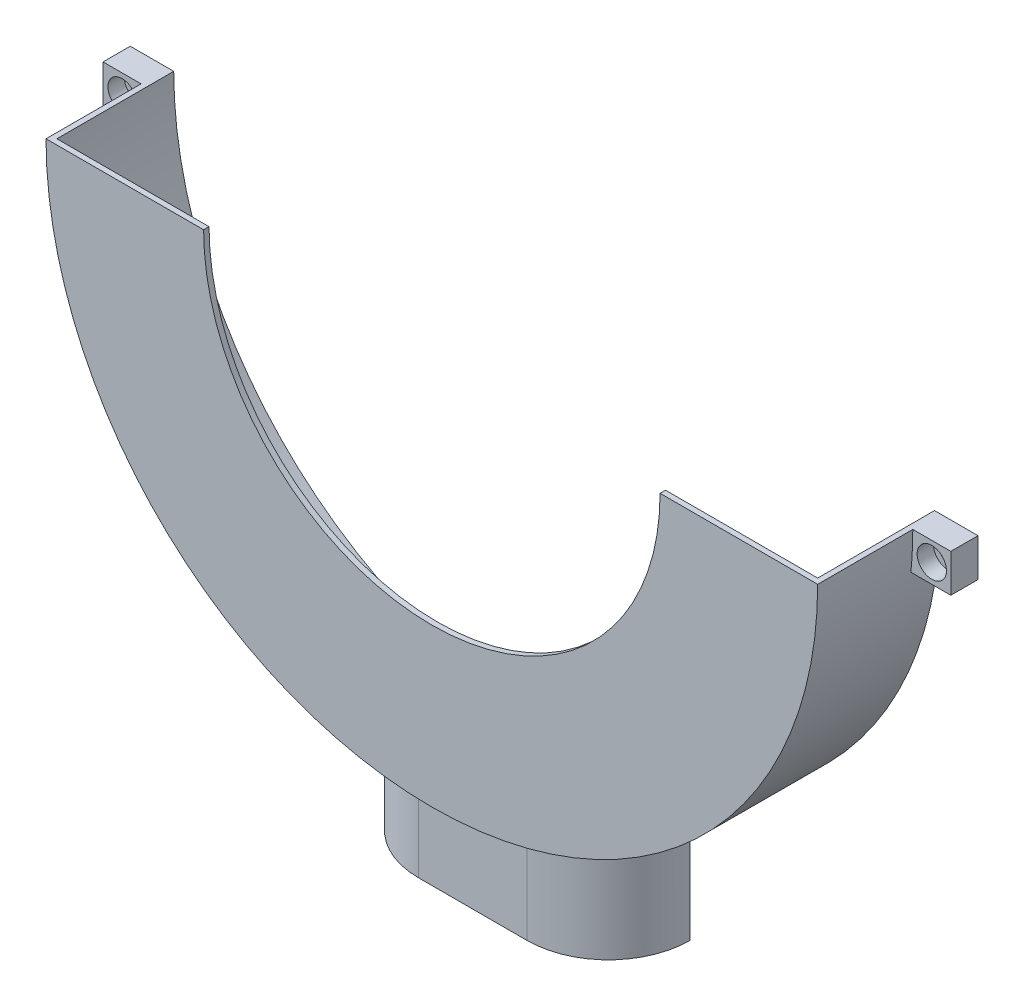
ISO-10303-21;
HEADER;
FILE_DESCRIPTION(('STEP AP214'),'2;1');
FILE_NAME('part.step','',(''),(''),'','','');
FILE_SCHEMA(('AUTOMOTIVE_DESIGN { 1 0 10303 214 1 1 1 1 }'));
ENDSEC;
DATA;
#1=APPLICATION_CONTEXT('core data for automotive mechanical design processes');
#2=APPLICATION_PROTOCOL_DEFINITION('international standard','automotive_design',2000,#1);
#3=PRODUCT_CONTEXT('',#1,'mechanical');
#4=PRODUCT('Part','Part','',(#3));
#5=PRODUCT_RELATED_PRODUCT_CATEGORY('part','',(#4));
#6=PRODUCT_DEFINITION_FORMATION('','',#4);
#7=PRODUCT_DEFINITION_CONTEXT('part definition',#1,'design');
#8=PRODUCT_DEFINITION('design','',#6,#7);
#9=PRODUCT_DEFINITION_SHAPE('','',#8);
#10=(LENGTH_UNIT() NAMED_UNIT(*) SI_UNIT(.MILLI.,.METRE.));
#11=(NAMED_UNIT(*) PLANE_ANGLE_UNIT() SI_UNIT($,.RADIAN.));
#12=(NAMED_UNIT(*) SI_UNIT($,.STERADIAN.) SOLID_ANGLE_UNIT());
#13=UNCERTAINTY_MEASURE_WITH_UNIT(LENGTH_MEASURE(1.E-05),#10,'distance_accuracy_value','');
#14=(GEOMETRIC_REPRESENTATION_CONTEXT(3) GLOBAL_UNCERTAINTY_ASSIGNED_CONTEXT((#13)) GLOBAL_UNIT_ASSIGNED_CONTEXT((#10,
#11,#12)) REPRESENTATION_CONTEXT('',''));
#15=CARTESIAN_POINT('',(0.,0.,0.));
#16=DIRECTION('',(0.,0.,1.));
#17=DIRECTION('',(1.,0.,0.));
#18=AXIS2_PLACEMENT_3D('',#15,#16,#17);
#19=CARTESIAN_POINT('',(0.,0.,0.));
#20=DIRECTION('',(0.,0.,1.));
#21=DIRECTION('',(1.,0.,0.));
#22=AXIS2_PLACEMENT_3D('',#19,#20,#21);
#23=PLANE('',#22);
#24=CARTESIAN_POINT('',(74.5,-3.49999999999999,0.));
#25=DIRECTION('',(0.,0.,-1.));
#26=DIRECTION('',(-1.,0.,0.));
#27=AXIS2_PLACEMENT_3D('',#24,#25,#26);
#28=CIRCLE('',#27,1.60000000000001);
#29=CARTESIAN_POINT('',(72.9,-3.49999999999999,0.));
#30=VERTEX_POINT('',#29);
#31=EDGE_CURVE('E338',#30,#30,#28,.T.);
#32=ORIENTED_EDGE('',*,*,#31,.F.);
#33=EDGE_LOOP('',(#32));
#34=FACE_BOUND('',#33,.T.);
#35=CARTESIAN_POINT('',(-74.5,-3.50000000000002,0.));
#36=DIRECTION('',(0.,0.,1.));
#37=DIRECTION('',(1.,0.,0.));
#38=AXIS2_PLACEMENT_3D('',#35,#36,#37);
#39=CIRCLE('',#38,1.60000000000001);
#40=CARTESIAN_POINT('',(-72.9,-3.50000000000002,0.));
#41=VERTEX_POINT('',#40);
#42=EDGE_CURVE('E356',#41,#41,#39,.T.);
#43=ORIENTED_EDGE('',*,*,#42,.T.);
#44=EDGE_LOOP('',(#43));
#45=FACE_BOUND('',#44,.T.);
#46=DIRECTION('',(0.,-1.,0.));
#47=VECTOR('',#46,1.);
#48=CARTESIAN_POINT('',(21.6189500386222,-71.,0.));
#49=LINE('',#48,#47);
#50=CARTESIAN_POINT('',(21.6189500386222,-71.,0.));
#51=VERTEX_POINT('',#50);
#52=CARTESIAN_POINT('',(21.6189500386222,-91.,0.));
#53=VERTEX_POINT('',#52);
#54=EDGE_CURVE('E304',#51,#53,#49,.T.);
#55=ORIENTED_EDGE('',*,*,#54,.F.);
#56=DIRECTION('',(1.,0.,0.));
#57=VECTOR('',#56,1.);
#58=CARTESIAN_POINT('',(0.,-71.,0.));
#59=LINE('',#58,#57);
#60=CARTESIAN_POINT('',(-21.6189500386223,-71.,0.));
#61=VERTEX_POINT('',#60);
#62=EDGE_CURVE('E270',#61,#51,#59,.T.);
#63=ORIENTED_EDGE('',*,*,#62,.F.);
#64=DIRECTION('',(0.,-1.,0.));
#65=VECTOR('',#64,1.);
#66=CARTESIAN_POINT('',(-21.6189500386223,-71.,0.));
#67=LINE('',#66,#65);
#68=CARTESIAN_POINT('',(-21.6189500386223,-91.,0.));
#69=VERTEX_POINT('',#68);
#70=EDGE_CURVE('E307',#61,#69,#67,.T.);
#71=ORIENTED_EDGE('',*,*,#70,.T.);
#72=DIRECTION('',(-1.,0.,0.));
#73=VECTOR('',#72,1.);
#74=CARTESIAN_POINT('',(0.,-91.,0.));
#75=LINE('',#74,#73);
#76=CARTESIAN_POINT('',(-25.,-91.,0.));
#77=VERTEX_POINT('',#76);
#78=EDGE_CURVE('E390',#69,#77,#75,.T.);
#79=ORIENTED_EDGE('',*,*,#78,.T.);
#80=DIRECTION('',(0.,1.,0.));
#81=VECTOR('',#80,1.);
#82=CARTESIAN_POINT('',(-25.,0.,0.));
#83=LINE('',#82,#81);
#84=CARTESIAN_POINT('',(-25.,-66.4529909033446,0.));
#85=VERTEX_POINT('',#84);
#86=EDGE_CURVE('E384',#77,#85,#83,.T.);
#87=ORIENTED_EDGE('',*,*,#86,.T.);
#88=CARTESIAN_POINT('',(0.,0.,0.));
#89=DIRECTION('',(0.,0.,1.));
#90=DIRECTION('',(1.,0.,0.));
#91=AXIS2_PLACEMENT_3D('',#88,#89,#90);
#92=CIRCLE('',#91,71.);
#93=CARTESIAN_POINT('',(-70.6540869306228,-7.00000000000003,0.));
#94=VERTEX_POINT('',#93);
#95=EDGE_CURVE('E430',#94,#85,#92,.T.);
#96=ORIENTED_EDGE('',*,*,#95,.F.);
#97=DIRECTION('',(1.,0.,0.));
#98=VECTOR('',#97,1.);
#99=CARTESIAN_POINT('',(-73.,-7.00000000000003,0.));
#100=LINE('',#99,#98);
#101=CARTESIAN_POINT('',(-78.,-7.00000000000003,0.));
#102=VERTEX_POINT('',#101);
#103=EDGE_CURVE('E365',#102,#94,#100,.T.);
#104=ORIENTED_EDGE('',*,*,#103,.F.);
#105=DIRECTION('',(0.,-1.,0.));
#106=VECTOR('',#105,1.);
#107=CARTESIAN_POINT('',(-78.,0.,0.));
#108=LINE('',#107,#106);
#109=CARTESIAN_POINT('',(-78.,0.,0.));
#110=VERTEX_POINT('',#109);
#111=EDGE_CURVE('E359',#110,#102,#108,.T.);
#112=ORIENTED_EDGE('',*,*,#111,.F.);
#113=DIRECTION('',(1.,0.,0.));
#114=VECTOR('',#113,1.);
#115=CARTESIAN_POINT('',(0.,0.,0.));
#116=LINE('',#115,#114);
#117=CARTESIAN_POINT('',(-70.,0.,0.));
#118=VERTEX_POINT('',#117);
#119=EDGE_CURVE('E426',#110,#118,#116,.T.);
#120=ORIENTED_EDGE('',*,*,#119,.T.);
#121=CARTESIAN_POINT('',(0.,0.,0.));
#122=DIRECTION('',(0.,0.,1.));
#123=DIRECTION('',(1.,0.,0.));
#124=AXIS2_PLACEMENT_3D('',#121,#122,#123);
#125=CIRCLE('',#124,70.);
#126=CARTESIAN_POINT('',(70.,0.,0.));
#127=VERTEX_POINT('',#126);
#128=EDGE_CURVE('E419',#118,#127,#125,.T.);
#129=ORIENTED_EDGE('',*,*,#128,.T.);
#130=CARTESIAN_POINT('',(78.,0.,0.));
#131=VERTEX_POINT('',#130);
#132=EDGE_CURVE('E424',#127,#131,#116,.T.);
#133=ORIENTED_EDGE('',*,*,#132,.T.);
#134=DIRECTION('',(0.,-1.,0.));
#135=VECTOR('',#134,1.);
#136=CARTESIAN_POINT('',(78.,0.,0.));
#137=LINE('',#136,#135);
#138=CARTESIAN_POINT('',(78.,-7.,0.));
#139=VERTEX_POINT('',#138);
#140=EDGE_CURVE('E331',#131,#139,#137,.T.);
#141=ORIENTED_EDGE('',*,*,#140,.T.);
#142=DIRECTION('',(-1.,0.,0.));
#143=VECTOR('',#142,1.);
#144=CARTESIAN_POINT('',(0.,-7.,0.));
#145=LINE('',#144,#143);
#146=CARTESIAN_POINT('',(70.6540869306228,-7.,0.));
#147=VERTEX_POINT('',#146);
#148=EDGE_CURVE('E341',#139,#147,#145,.T.);
#149=ORIENTED_EDGE('',*,*,#148,.T.);
#150=CARTESIAN_POINT('',(25.,-66.4529909033446,0.));
#151=VERTEX_POINT('',#150);
#152=EDGE_CURVE('E429',#151,#147,#92,.T.);
#153=ORIENTED_EDGE('',*,*,#152,.F.);
#154=DIRECTION('',(0.,1.,0.));
#155=VECTOR('',#154,1.);
#156=CARTESIAN_POINT('',(25.,0.,0.));
#157=LINE('',#156,#155);
#158=CARTESIAN_POINT('',(25.,-91.,0.));
#159=VERTEX_POINT('',#158);
#160=EDGE_CURVE('E387',#159,#151,#157,.T.);
#161=ORIENTED_EDGE('',*,*,#160,.F.);
#162=EDGE_CURVE('E391',#159,#53,#75,.T.);
#163=ORIENTED_EDGE('',*,*,#162,.T.);
#164=EDGE_LOOP('',(#55,#63,#71,#79,#87,#96,#104,#112,#120,#129,#133,#141,#149,#153,#161,#163));
#165=FACE_BOUND('',#164,.T.);
#166=ADVANCED_FACE('F107',(#34,#45,#165),#23,.F.);
#167=CARTESIAN_POINT('',(0.,-91.,15.));
#168=DIRECTION('',(0.,-1.,0.));
#169=DIRECTION('',(0.,0.,-1.));
#170=AXIS2_PLACEMENT_3D('',#167,#168,#169);
#171=PLANE('',#170);
#172=CARTESIAN_POINT('',(10.,-91.,0.));
#173=DIRECTION('',(0.,-1.,0.));
#174=DIRECTION('',(0.,0.,-1.));
#175=AXIS2_PLACEMENT_3D('',#172,#173,#174);
#176=CIRCLE('',#175,12.);
#177=CARTESIAN_POINT('',(21.6189500386222,-91.,3.));
#178=VERTEX_POINT('',#177);
#179=CARTESIAN_POINT('',(10.,-91.,12.));
#180=VERTEX_POINT('',#179);
#181=EDGE_CURVE('E295',#178,#180,#176,.T.);
#182=ORIENTED_EDGE('',*,*,#181,.F.);
#183=DIRECTION('',(0.,0.,-1.));
#184=VECTOR('',#183,1.);
#185=CARTESIAN_POINT('',(21.6189500386222,-91.,0.));
#186=LINE('',#185,#184);
#187=EDGE_CURVE('E128',#178,#53,#186,.T.);
#188=ORIENTED_EDGE('',*,*,#187,.T.);
#189=ORIENTED_EDGE('',*,*,#162,.F.);
#190=CARTESIAN_POINT('',(10.,-91.,0.));
#191=DIRECTION('',(0.,-1.,0.));
#192=DIRECTION('',(0.,0.,-1.));
#193=AXIS2_PLACEMENT_3D('',#190,#191,#192);
#194=CIRCLE('',#193,15.);
#195=CARTESIAN_POINT('',(10.,-91.,15.));
#196=VERTEX_POINT('',#195);
#197=EDGE_CURVE('E450',#159,#196,#194,.T.);
#198=ORIENTED_EDGE('',*,*,#197,.T.);
#199=DIRECTION('',(-1.,0.,0.));
#200=VECTOR('',#199,1.);
#201=CARTESIAN_POINT('',(0.,-91.,15.));
#202=LINE('',#201,#200);
#203=CARTESIAN_POINT('',(-10.,-91.,15.));
#204=VERTEX_POINT('',#203);
#205=EDGE_CURVE('E381',#196,#204,#202,.T.);
#206=ORIENTED_EDGE('',*,*,#205,.T.);
#207=CARTESIAN_POINT('',(-10.,-91.,0.));
#208=DIRECTION('',(0.,-1.,0.));
#209=DIRECTION('',(0.,0.,-1.));
#210=AXIS2_PLACEMENT_3D('',#207,#208,#209);
#211=CIRCLE('',#210,15.);
#212=EDGE_CURVE('E452',#204,#77,#211,.T.);
#213=ORIENTED_EDGE('',*,*,#212,.T.);
#214=ORIENTED_EDGE('',*,*,#78,.F.);
#215=DIRECTION('',(0.,0.,-1.));
#216=VECTOR('',#215,1.);
#217=CARTESIAN_POINT('',(-21.6189500386223,-91.,0.));
#218=LINE('',#217,#216);
#219=CARTESIAN_POINT('',(-21.6189500386223,-91.,3.));
#220=VERTEX_POINT('',#219);
#221=EDGE_CURVE('E280',#220,#69,#218,.T.);
#222=ORIENTED_EDGE('',*,*,#221,.F.);
#223=CARTESIAN_POINT('',(-10.,-91.,0.));
#224=DIRECTION('',(0.,-1.,0.));
#225=DIRECTION('',(0.,0.,-1.));
#226=AXIS2_PLACEMENT_3D('',#223,#224,#225);
#227=CIRCLE('',#226,12.);
#228=CARTESIAN_POINT('',(-10.,-91.,12.));
#229=VERTEX_POINT('',#228);
#230=EDGE_CURVE('E300',#229,#220,#227,.T.);
#231=ORIENTED_EDGE('',*,*,#230,.F.);
#232=DIRECTION('',(-1.,0.,0.));
#233=VECTOR('',#232,1.);
#234=CARTESIAN_POINT('',(0.,-91.,12.));
#235=LINE('',#234,#233);
#236=EDGE_CURVE('E297',#180,#229,#235,.T.);
#237=ORIENTED_EDGE('',*,*,#236,.F.);
#238=EDGE_LOOP('',(#182,#188,#189,#198,#206,#213,#214,#222,#231,#237));
#239=FACE_BOUND('',#238,.T.);
#240=ADVANCED_FACE('F480',(#239),#171,.T.);
#241=CARTESIAN_POINT('',(74.5,-3.49999999999999,5.));
#242=DIRECTION('',(0.,0.,-1.));
#243=DIRECTION('',(-1.,0.,0.));
#244=AXIS2_PLACEMENT_3D('',#241,#242,#243);
#245=CYLINDRICAL_SURFACE('',#244,1.60000000000001);
#246=ORIENTED_EDGE('',*,*,#31,.T.);
#247=EDGE_LOOP('',(#246));
#248=FACE_BOUND('',#247,.T.);
#249=CARTESIAN_POINT('',(74.5,-3.49999999999999,2.));
#250=DIRECTION('',(0.,0.,1.));
#251=DIRECTION('',(1.,0.,0.));
#252=AXIS2_PLACEMENT_3D('',#249,#250,#251);
#253=CIRCLE('',#252,1.60000000000001);
#254=CARTESIAN_POINT('',(76.1,-3.49999999999999,2.));
#255=VERTEX_POINT('',#254);
#256=EDGE_CURVE('E360',#255,#255,#253,.F.);
#257=ORIENTED_EDGE('',*,*,#256,.F.);
#258=EDGE_LOOP('',(#257));
#259=FACE_BOUND('',#258,.T.);
#260=ADVANCED_FACE('F486',(#248,#259),#245,.F.);
#261=CARTESIAN_POINT('',(-74.5,-3.50000000000002,5.));
#262=DIRECTION('',(0.,0.,-1.));
#263=DIRECTION('',(-1.,0.,0.));
#264=AXIS2_PLACEMENT_3D('',#261,#262,#263);
#265=CYLINDRICAL_SURFACE('',#264,1.60000000000001);
#266=ORIENTED_EDGE('',*,*,#42,.F.);
#267=EDGE_LOOP('',(#266));
#268=FACE_BOUND('',#267,.T.);
#269=CARTESIAN_POINT('',(-74.5,-3.50000000000002,2.));
#270=DIRECTION('',(0.,0.,1.));
#271=DIRECTION('',(1.,0.,0.));
#272=AXIS2_PLACEMENT_3D('',#269,#270,#271);
#273=CIRCLE('',#272,1.60000000000001);
#274=CARTESIAN_POINT('',(-72.9,-3.50000000000002,2.));
#275=VERTEX_POINT('',#274);
#276=EDGE_CURVE('E318',#275,#275,#273,.T.);
#277=ORIENTED_EDGE('',*,*,#276,.T.);
#278=EDGE_LOOP('',(#277));
#279=FACE_BOUND('',#278,.T.);
#280=ADVANCED_FACE('F477',(#268,#279),#265,.F.);
#281=CARTESIAN_POINT('',(0.,0.,21.5));
#282=DIRECTION('',(0.,0.,-1.));
#283=DIRECTION('',(-1.,0.,0.));
#284=AXIS2_PLACEMENT_3D('',#281,#282,#283);
#285=CYLINDRICAL_SURFACE('',#284,71.);
#286=ORIENTED_EDGE('',*,*,#95,.T.);
#287=CARTESIAN_POINT('',(-25.,-66.4529909033446,0.));
#288=CARTESIAN_POINT('',(-25.0000005903524,-66.4529892917345,0.202890123291094));
#289=CARTESIAN_POINT('',(-24.9958827959298,-66.4545399945073,0.405754132783713));
#290=CARTESIAN_POINT('',(-24.9794283711578,-66.4607272766142,0.811094434555971));
#291=CARTESIAN_POINT('',(-24.9670920257694,-66.4653637489557,1.01357074003433));
#292=CARTESIAN_POINT('',(-24.917797028508,-66.4838680768963,1.61974669485583));
#293=CARTESIAN_POINT('',(-24.8685523791685,-66.5023308782734,2.02238403361912));
#294=CARTESIAN_POINT('',(-24.737993198442,-66.5510066828299,2.82038996686675));
#295=CARTESIAN_POINT('',(-24.6567755820139,-66.5811841731827,3.21577678312238));
#296=CARTESIAN_POINT('',(-24.4630499639891,-66.6526056042619,3.99780486330627));
#297=CARTESIAN_POINT('',(-24.3505410103259,-66.6938498817037,4.38444586074817));
#298=CARTESIAN_POINT('',(-24.0953419993637,-66.7864723363784,5.14612284370514));
#299=CARTESIAN_POINT('',(-23.9526689943176,-66.8378447868793,5.52116524936546));
#300=CARTESIAN_POINT('',(-23.638324992462,-66.9496631926846,6.25750406523527));
#301=CARTESIAN_POINT('',(-23.4666523229956,-67.0101096713426,6.61879968107707));
#302=CARTESIAN_POINT('',(-23.0956020324913,-67.1388987831489,7.325612948941));
#303=CARTESIAN_POINT('',(-22.8962112994059,-67.2072451507505,7.67112303022247));
#304=CARTESIAN_POINT('',(-22.4712659315399,-67.3505194327208,8.34421645846842));
#305=CARTESIAN_POINT('',(-22.2457107012023,-67.4254474968928,8.67179939712486));
#306=CARTESIAN_POINT('',(-21.7615525631412,-67.5832961350776,9.31851766812734));
#307=CARTESIAN_POINT('',(-21.5020617801036,-67.6664058484265,9.63694224659087));
#308=CARTESIAN_POINT('',(-20.9583899157298,-67.8367677003514,10.2509462698629));
#309=CARTESIAN_POINT('',(-20.6742009101862,-67.9240211643104,10.5465183247368));
#310=CARTESIAN_POINT('',(-20.0829901748955,-68.1011653816012,11.1130988985723));
#311=CARTESIAN_POINT('',(-19.7759650826353,-68.1910565221346,11.3841037870398));
#312=CARTESIAN_POINT('',(-19.1410012430146,-68.3720048524889,11.8999762900218));
#313=CARTESIAN_POINT('',(-18.8130617028942,-68.4630620864058,12.1448429128263));
#314=CARTESIAN_POINT('',(-18.1218416025611,-68.6493487369842,12.6182231879232));
#315=CARTESIAN_POINT('',(-17.7576183066252,-68.744566193301,12.845366685592));
#316=CARTESIAN_POINT('',(-17.0108165521357,-68.9331587207391,13.2677206815555));
#317=CARTESIAN_POINT('',(-16.6282441960605,-69.0265343900152,13.4629417025938));
#318=CARTESIAN_POINT('',(-15.8472721857437,-69.2100050478546,13.8200473386814));
#319=CARTESIAN_POINT('',(-15.4488785608921,-69.3001012615813,13.9819445105397));
#320=CARTESIAN_POINT('',(-14.6388107248533,-69.4757285989762,14.2711708026575));
#321=CARTESIAN_POINT('',(-14.2271392023012,-69.5612606376462,14.3985068726197));
#322=CARTESIAN_POINT('',(-13.5009067949091,-69.7052730446685,14.5892427530184));
#323=CARTESIAN_POINT('',(-13.1886811773013,-69.7650412692188,14.660662313501));
#324=CARTESIAN_POINT('',(-12.559703961304,-69.881013679575,14.7834554064761));
#325=CARTESIAN_POINT('',(-12.242953253642,-69.9372185552684,14.8348328292425));
#326=CARTESIAN_POINT('',(-11.6062572804768,-70.045691676637,14.9172020304908));
#327=CARTESIAN_POINT('',(-11.2863131375469,-70.0979612540486,14.9482007330017));
#328=CARTESIAN_POINT('',(-10.6443571537927,-70.1983170317084,14.9896100135823));
#329=CARTESIAN_POINT('',(-10.3223447877684,-70.2464021202939,15.0000151365729));
#330=CARTESIAN_POINT('',(-10.,-70.2922470831599,15.));
#331=B_SPLINE_CURVE_WITH_KNOTS('',3,(#287,#288,#289,#290,#291,#292,#293,#294,#295,#296,#297,
#298,#299,#300,#301,#302,#303,#304,#305,#306,#307,#308,#309,#310,#311,#312,#313,#314,#315,#316,
#317,#318,#319,#320,#321,#322,#323,#324,#325,#326,#327,#328,#329,#330),.UNSPECIFIED.,.F.,.F.,(4,
2,2,2,2,2,2,2,2,2,2,2,2,2,2,2,2,2,2,2,2,4),(0.,0.608570725485435,1.21712035115968,
2.43364958759041,3.6465193843696,4.85942608782073,6.07164893913068,7.28394173351149,
8.4968099677002,9.70970581465124,10.9655839571441,12.2218665352263,13.4783344629911,
14.7348500453823,16.052339464034,17.3693937136526,18.6859507698999,20.0022428904329,
20.9790765747016,21.9557205564564,22.9320325344798,23.9086030953595),.UNSPECIFIED.);
#332=CARTESIAN_POINT('',(-10.,-70.2922470831599,15.));
#333=VERTEX_POINT('',#332);
#334=EDGE_CURVE('E121',#85,#333,#331,.T.);
#335=ORIENTED_EDGE('',*,*,#334,.T.);
#336=CARTESIAN_POINT('',(0.,0.,15.));
#337=DIRECTION('',(0.,0.,-1.));
#338=DIRECTION('',(-1.,0.,0.));
#339=AXIS2_PLACEMENT_3D('',#336,#337,#338);
#340=CIRCLE('',#339,71.);
#341=CARTESIAN_POINT('',(10.,-70.2922470831599,15.));
#342=VERTEX_POINT('',#341);
#343=EDGE_CURVE('E383',#342,#333,#340,.T.);
#344=ORIENTED_EDGE('',*,*,#343,.F.);
#345=CARTESIAN_POINT('',(10.,-70.2922470831599,15.));
#346=CARTESIAN_POINT('',(10.2139363859511,-70.2618131813049,14.9999999695141));
#347=CARTESIAN_POINT('',(10.4277051094957,-70.2304036050421,14.9954224227743));
#348=CARTESIAN_POINT('',(10.8545616919083,-70.1656971947847,14.9771615807701));
#349=CARTESIAN_POINT('',(11.0676495677583,-70.1324004082562,14.9634785144299));
#350=CARTESIAN_POINT('',(11.7051948561132,-70.0298043608516,14.9088613094986));
#351=CARTESIAN_POINT('',(12.1281307104455,-69.9577713905516,14.8543590709993));
#352=CARTESIAN_POINT('',(12.9658575720154,-69.8073592833812,14.7099992636987));
#353=CARTESIAN_POINT('',(13.38066245696,-69.7289923927318,14.6202086824519));
#354=CARTESIAN_POINT('',(14.2002005596321,-69.5667218100454,14.4061675282177));
#355=CARTESIAN_POINT('',(14.6049333766161,-69.482817898187,14.2819155864766));
#356=CARTESIAN_POINT('',(15.4014290237364,-69.3106193224046,14.0001054081002));
#357=CARTESIAN_POINT('',(15.7931979514005,-69.2223267730018,13.8425630946279));
#358=CARTESIAN_POINT('',(16.5614840552444,-69.0425442255805,13.4953562211368));
#359=CARTESIAN_POINT('',(16.938000614122,-68.9510540984265,13.3056903626025));
#360=CARTESIAN_POINT('',(17.6735305808308,-68.7661993899087,12.8955148799361));
#361=CARTESIAN_POINT('',(18.032537974225,-68.6728341797823,12.6749947565357));
#362=CARTESIAN_POINT('',(18.7306774207431,-68.4857090970559,12.2046075236882));
#363=CARTESIAN_POINT('',(19.0698091836421,-68.3919492187143,11.9547399858686));
#364=CARTESIAN_POINT('',(19.7333109621519,-68.2035043083046,11.4213751539266));
#365=CARTESIAN_POINT('',(20.0571892910213,-68.1088446037796,11.1372568191024));
#366=CARTESIAN_POINT('',(20.6797377755465,-67.9224119999273,10.541761974096));
#367=CARTESIAN_POINT('',(20.978408146774,-67.8306390759171,10.2303856970631));
#368=CARTESIAN_POINT('',(21.5484605400567,-67.6517045696799,9.58224126580219));
#369=CARTESIAN_POINT('',(21.8198378835186,-67.5645437792779,9.24546877538898));
#370=CARTESIAN_POINT('',(22.3331625384014,-67.3966082376737,8.5487036026553));
#371=CARTESIAN_POINT('',(22.5751109373863,-67.3158332505191,8.18871177917181));
#372=CARTESIAN_POINT('',(23.0255159856525,-67.1630975470954,7.45123442050554));
#373=CARTESIAN_POINT('',(23.2342590464413,-67.0910628877752,7.07393927329259));
#374=CARTESIAN_POINT('',(23.6190459412865,-66.9565697350019,6.30141160948439));
#375=CARTESIAN_POINT('',(23.795092157202,-66.8941105440649,5.90618040208504));
#376=CARTESIAN_POINT('',(24.1126449130714,-66.7803025975163,5.10100870037129));
#377=CARTESIAN_POINT('',(24.2541888866319,-66.7289418074986,4.69108470625582));
#378=CARTESIAN_POINT('',(24.5014780114503,-66.638539031647,3.85944868122548));
#379=CARTESIAN_POINT('',(24.60723609383,-66.5994925964062,3.43774096808075));
#380=CARTESIAN_POINT('',(24.7958654854792,-66.5295194123323,2.51729050082726));
#381=CARTESIAN_POINT('',(24.8723544259504,-66.5008961545058,2.01703122498264));
#382=CARTESIAN_POINT('',(24.9488991574379,-66.4721976200543,1.26268578907946));
#383=CARTESIAN_POINT('',(24.9680492680456,-66.4650041891141,1.01064489386477));
#384=CARTESIAN_POINT('',(24.9936017649907,-66.4553984058687,0.505754579709946));
#385=CARTESIAN_POINT('',(25.000000495831,-66.4529874245715,0.252904949727254));
#386=CARTESIAN_POINT('',(25.,-66.4529909033446,0.));
#387=B_SPLINE_CURVE_WITH_KNOTS('',3,(#345,#346,#347,#348,#349,#350,#351,#352,#353,#354,#355,
#356,#357,#358,#359,#360,#361,#362,#363,#364,#365,#366,#367,#368,#369,#370,#371,#372,#373,#374,
#375,#376,#377,#378,#379,#380,#381,#382,#383,#384,#385,#386),.UNSPECIFIED.,.F.,.F.,(4,2,2,2,2,2,
2,2,2,2,2,2,2,2,2,2,2,2,2,2,4),(0.,0.648163931239846,1.2963115674376,2.59201254012226,
3.88526568393931,5.17857020120226,6.47125751081972,7.76399708662323,9.05717763808697,
10.350377067933,11.6721482407039,12.9939081088883,14.31589416942,15.6378313603238,
16.9476628861356,18.2573989575104,19.5657076266864,20.8735430364311,22.3909334861488,
23.1492287751872,23.9077414170007),.UNSPECIFIED.);
#388=EDGE_CURVE('E12',#342,#151,#387,.T.);
#389=ORIENTED_EDGE('',*,*,#388,.T.);
#390=ORIENTED_EDGE('',*,*,#152,.T.);
#391=DIRECTION('',(0.,0.,-1.));
#392=VECTOR('',#391,1.);
#393=CARTESIAN_POINT('',(70.6540869306228,-7.,5.));
#394=LINE('',#393,#392);
#395=CARTESIAN_POINT('',(70.6540869306228,-7.,5.));
#396=VERTEX_POINT('',#395);
#397=EDGE_CURVE('E337',#396,#147,#394,.T.);
#398=ORIENTED_EDGE('',*,*,#397,.F.);
#399=CARTESIAN_POINT('',(0.,0.,5.));
#400=DIRECTION('',(0.,0.,-1.));
#401=DIRECTION('',(-1.,0.,0.));
#402=AXIS2_PLACEMENT_3D('',#399,#400,#401);
#403=CIRCLE('',#402,71.);
#404=CARTESIAN_POINT('',(71.,0.,5.));
#405=VERTEX_POINT('',#404);
#406=EDGE_CURVE('E380',#405,#396,#403,.T.);
#407=ORIENTED_EDGE('',*,*,#406,.F.);
#408=DIRECTION('',(0.,0.,-1.));
#409=VECTOR('',#408,1.);
#410=CARTESIAN_POINT('',(71.,0.,21.5));
#411=LINE('',#410,#409);
#412=CARTESIAN_POINT('',(71.,0.,22.5));
#413=VERTEX_POINT('',#412);
#414=EDGE_CURVE('E435',#413,#405,#411,.T.);
#415=ORIENTED_EDGE('',*,*,#414,.F.);
#416=CARTESIAN_POINT('',(0.,0.,22.5));
#417=DIRECTION('',(0.,0.,1.));
#418=DIRECTION('',(1.,0.,0.));
#419=AXIS2_PLACEMENT_3D('',#416,#417,#418);
#420=CIRCLE('',#419,71.);
#421=CARTESIAN_POINT('',(-71.,0.,22.5));
#422=VERTEX_POINT('',#421);
#423=EDGE_CURVE('E405',#422,#413,#420,.T.);
#424=ORIENTED_EDGE('',*,*,#423,.F.);
#425=DIRECTION('',(0.,0.,-1.));
#426=VECTOR('',#425,1.);
#427=CARTESIAN_POINT('',(-71.,0.,21.5));
#428=LINE('',#427,#426);
#429=CARTESIAN_POINT('',(-71.,0.,5.));
#430=VERTEX_POINT('',#429);
#431=EDGE_CURVE('E438',#422,#430,#428,.T.);
#432=ORIENTED_EDGE('',*,*,#431,.T.);
#433=CARTESIAN_POINT('',(-70.6540869306228,-7.00000000000003,5.));
#434=VERTEX_POINT('',#433);
#435=EDGE_CURVE('E349',#434,#430,#403,.T.);
#436=ORIENTED_EDGE('',*,*,#435,.F.);
#437=DIRECTION('',(0.,0.,-1.));
#438=VECTOR('',#437,1.);
#439=CARTESIAN_POINT('',(-70.6540869306228,-7.00000000000003,5.));
#440=LINE('',#439,#438);
#441=EDGE_CURVE('E353',#434,#94,#440,.T.);
#442=ORIENTED_EDGE('',*,*,#441,.T.);
#443=EDGE_LOOP('',(#286,#335,#344,#389,#390,#398,#407,#415,#424,#432,#436,#442));
#444=FACE_BOUND('',#443,.T.);
#445=ADVANCED_FACE('F458',(#444),#285,.T.);
#446=CARTESIAN_POINT('',(0.,0.,21.5));
#447=DIRECTION('',(0.,0.,-1.));
#448=DIRECTION('',(-1.,0.,0.));
#449=AXIS2_PLACEMENT_3D('',#446,#447,#448);
#450=CYLINDRICAL_SURFACE('',#449,70.);
#451=DIRECTION('',(0.,0.,-1.));
#452=VECTOR('',#451,1.);
#453=CARTESIAN_POINT('',(70.,0.,21.5));
#454=LINE('',#453,#452);
#455=CARTESIAN_POINT('',(70.,0.,21.5));
#456=VERTEX_POINT('',#455);
#457=EDGE_CURVE('E423',#456,#127,#454,.T.);
#458=ORIENTED_EDGE('',*,*,#457,.T.);
#459=ORIENTED_EDGE('',*,*,#128,.F.);
#460=DIRECTION('',(0.,0.,-1.));
#461=VECTOR('',#460,1.);
#462=CARTESIAN_POINT('',(-70.,0.,21.5));
#463=LINE('',#462,#461);
#464=CARTESIAN_POINT('',(-70.,0.,21.5));
#465=VERTEX_POINT('',#464);
#466=EDGE_CURVE('E440',#465,#118,#463,.T.);
#467=ORIENTED_EDGE('',*,*,#466,.F.);
#468=CARTESIAN_POINT('',(0.,0.,21.5));
#469=DIRECTION('',(0.,0.,1.));
#470=DIRECTION('',(1.,0.,0.));
#471=AXIS2_PLACEMENT_3D('',#468,#469,#470);
#472=CIRCLE('',#471,70.);
#473=EDGE_CURVE('E420',#465,#456,#472,.T.);
#474=ORIENTED_EDGE('',*,*,#473,.T.);
#475=EDGE_LOOP('',(#458,#459,#467,#474));
#476=FACE_BOUND('',#475,.T.);
#477=ADVANCED_FACE('F467',(#476),#450,.F.);
#478=CARTESIAN_POINT('',(0.,0.,21.5));
#479=DIRECTION('',(0.,1.,0.));
#480=DIRECTION('',(-1.,0.,0.));
#481=AXIS2_PLACEMENT_3D('',#478,#479,#480);
#482=PLANE('',#481);
#483=ORIENTED_EDGE('',*,*,#119,.F.);
#484=DIRECTION('',(0.,0.,-1.));
#485=VECTOR('',#484,1.);
#486=CARTESIAN_POINT('',(-78.,0.,5.));
#487=LINE('',#486,#485);
#488=CARTESIAN_POINT('',(-78.,0.,5.));
#489=VERTEX_POINT('',#488);
#490=EDGE_CURVE('E369',#489,#110,#487,.T.);
#491=ORIENTED_EDGE('',*,*,#490,.F.);
#492=DIRECTION('',(-1.,0.,0.));
#493=VECTOR('',#492,1.);
#494=CARTESIAN_POINT('',(-71.,-5.23545925731354E-13,5.));
#495=LINE('',#494,#493);
#496=EDGE_CURVE('E367',#430,#489,#495,.T.);
#497=ORIENTED_EDGE('',*,*,#496,.F.);
#498=ORIENTED_EDGE('',*,*,#431,.F.);
#499=DIRECTION('',(-1.,0.,0.));
#500=VECTOR('',#499,1.);
#501=CARTESIAN_POINT('',(0.,0.,22.5));
#502=LINE('',#501,#500);
#503=CARTESIAN_POINT('',(-42.,0.,22.5));
#504=VERTEX_POINT('',#503);
#505=EDGE_CURVE('E402',#504,#422,#502,.T.);
#506=ORIENTED_EDGE('',*,*,#505,.F.);
#507=DIRECTION('',(0.,0.,-1.));
#508=VECTOR('',#507,1.);
#509=CARTESIAN_POINT('',(-42.,0.,22.5));
#510=LINE('',#509,#508);
#511=CARTESIAN_POINT('',(-42.,0.,21.5));
#512=VERTEX_POINT('',#511);
#513=EDGE_CURVE('E408',#504,#512,#510,.T.);
#514=ORIENTED_EDGE('',*,*,#513,.T.);
#515=DIRECTION('',(-1.,0.,0.));
#516=VECTOR('',#515,1.);
#517=CARTESIAN_POINT('',(0.,0.,21.5));
#518=LINE('',#517,#516);
#519=EDGE_CURVE('E399',#512,#465,#518,.T.);
#520=ORIENTED_EDGE('',*,*,#519,.T.);
#521=ORIENTED_EDGE('',*,*,#466,.T.);
#522=EDGE_LOOP('',(#483,#491,#497,#498,#506,#514,#520,#521));
#523=FACE_BOUND('',#522,.T.);
#524=ADVANCED_FACE('F469',(#523),#482,.T.);
#525=ORIENTED_EDGE('',*,*,#132,.F.);
#526=ORIENTED_EDGE('',*,*,#457,.F.);
#527=DIRECTION('',(-1.,0.,0.));
#528=VECTOR('',#527,1.);
#529=CARTESIAN_POINT('',(0.,0.,21.5));
#530=LINE('',#529,#528);
#531=CARTESIAN_POINT('',(42.,0.,21.5));
#532=VERTEX_POINT('',#531);
#533=EDGE_CURVE('E386',#456,#532,#530,.T.);
#534=ORIENTED_EDGE('',*,*,#533,.T.);
#535=DIRECTION('',(0.,0.,-1.));
#536=VECTOR('',#535,1.);
#537=CARTESIAN_POINT('',(42.,0.,22.5));
#538=LINE('',#537,#536);
#539=CARTESIAN_POINT('',(42.,0.,22.5));
#540=VERTEX_POINT('',#539);
#541=EDGE_CURVE('E416',#540,#532,#538,.T.);
#542=ORIENTED_EDGE('',*,*,#541,.F.);
#543=DIRECTION('',(-1.,0.,0.));
#544=VECTOR('',#543,1.);
#545=CARTESIAN_POINT('',(0.,0.,22.5));
#546=LINE('',#545,#544);
#547=EDGE_CURVE('E396',#413,#540,#546,.T.);
#548=ORIENTED_EDGE('',*,*,#547,.F.);
#549=ORIENTED_EDGE('',*,*,#414,.T.);
#550=DIRECTION('',(1.,0.,0.));
#551=VECTOR('',#550,1.);
#552=CARTESIAN_POINT('',(0.,-5.51582605187271E-12,5.));
#553=LINE('',#552,#551);
#554=CARTESIAN_POINT('',(78.,0.,5.));
#555=VERTEX_POINT('',#554);
#556=EDGE_CURVE('E330',#405,#555,#553,.T.);
#557=ORIENTED_EDGE('',*,*,#556,.T.);
#558=DIRECTION('',(0.,0.,-1.));
#559=VECTOR('',#558,1.);
#560=CARTESIAN_POINT('',(78.,0.,5.));
#561=LINE('',#560,#559);
#562=EDGE_CURVE('E350',#555,#131,#561,.T.);
#563=ORIENTED_EDGE('',*,*,#562,.T.);
#564=EDGE_LOOP('',(#525,#526,#534,#542,#548,#549,#557,#563));
#565=FACE_BOUND('',#564,.T.);
#566=ADVANCED_FACE('F475',(#565),#482,.T.);
#567=CARTESIAN_POINT('',(0.,0.,21.5));
#568=DIRECTION('',(0.,0.,1.));
#569=DIRECTION('',(1.,0.,0.));
#570=AXIS2_PLACEMENT_3D('',#567,#568,#569);
#571=PLANE('',#570);
#572=ORIENTED_EDGE('',*,*,#473,.F.);
#573=ORIENTED_EDGE('',*,*,#519,.F.);
#574=CARTESIAN_POINT('',(0.,0.,21.5));
#575=DIRECTION('',(0.,0.,1.));
#576=DIRECTION('',(1.,0.,0.));
#577=AXIS2_PLACEMENT_3D('',#574,#575,#576);
#578=CIRCLE('',#577,42.);
#579=EDGE_CURVE('E410',#512,#532,#578,.T.);
#580=ORIENTED_EDGE('',*,*,#579,.T.);
#581=ORIENTED_EDGE('',*,*,#533,.F.);
#582=EDGE_LOOP('',(#572,#573,#580,#581));
#583=FACE_BOUND('',#582,.T.);
#584=ADVANCED_FACE('F495',(#583),#571,.F.);
#585=CARTESIAN_POINT('',(0.,0.,22.5));
#586=DIRECTION('',(0.,0.,-1.));
#587=DIRECTION('',(-1.,0.,0.));
#588=AXIS2_PLACEMENT_3D('',#585,#586,#587);
#589=CYLINDRICAL_SURFACE('',#588,42.);
#590=ORIENTED_EDGE('',*,*,#579,.F.);
#591=ORIENTED_EDGE('',*,*,#513,.F.);
#592=CARTESIAN_POINT('',(0.,0.,22.5));
#593=DIRECTION('',(0.,0.,1.));
#594=DIRECTION('',(1.,0.,0.));
#595=AXIS2_PLACEMENT_3D('',#592,#593,#594);
#596=CIRCLE('',#595,42.);
#597=EDGE_CURVE('E398',#504,#540,#596,.T.);
#598=ORIENTED_EDGE('',*,*,#597,.T.);
#599=ORIENTED_EDGE('',*,*,#541,.T.);
#600=EDGE_LOOP('',(#590,#591,#598,#599));
#601=FACE_BOUND('',#600,.T.);
#602=ADVANCED_FACE('F492',(#601),#589,.F.);
#603=CARTESIAN_POINT('',(0.,0.,22.5));
#604=DIRECTION('',(0.,0.,1.));
#605=DIRECTION('',(1.,0.,0.));
#606=AXIS2_PLACEMENT_3D('',#603,#604,#605);
#607=PLANE('',#606);
#608=ORIENTED_EDGE('',*,*,#547,.T.);
#609=ORIENTED_EDGE('',*,*,#597,.F.);
#610=ORIENTED_EDGE('',*,*,#505,.T.);
#611=ORIENTED_EDGE('',*,*,#423,.T.);
#612=EDGE_LOOP('',(#608,#609,#610,#611));
#613=FACE_BOUND('',#612,.T.);
#614=ADVANCED_FACE('F516',(#613),#607,.T.);
#615=CARTESIAN_POINT('',(0.,0.,15.));
#616=DIRECTION('',(0.,0.,-1.));
#617=DIRECTION('',(-1.,0.,0.));
#618=AXIS2_PLACEMENT_3D('',#615,#616,#617);
#619=PLANE('',#618);
#620=ORIENTED_EDGE('',*,*,#343,.T.);
#621=DIRECTION('',(0.,1.,0.));
#622=VECTOR('',#621,1.);
#623=CARTESIAN_POINT('',(-10.,-91.,15.));
#624=LINE('',#623,#622);
#625=EDGE_CURVE('E136',#333,#204,#624,.F.);
#626=ORIENTED_EDGE('',*,*,#625,.T.);
#627=ORIENTED_EDGE('',*,*,#205,.F.);
#628=DIRECTION('',(0.,1.,0.));
#629=VECTOR('',#628,1.);
#630=CARTESIAN_POINT('',(10.,0.,15.));
#631=LINE('',#630,#629);
#632=EDGE_CURVE('E442',#196,#342,#631,.T.);
#633=ORIENTED_EDGE('',*,*,#632,.T.);
#634=EDGE_LOOP('',(#620,#626,#627,#633));
#635=FACE_BOUND('',#634,.T.);
#636=ADVANCED_FACE('F539',(#635),#619,.F.);
#637=CARTESIAN_POINT('',(0.,-7.,5.));
#638=DIRECTION('',(0.,-1.,0.));
#639=DIRECTION('',(0.,0.,-1.));
#640=AXIS2_PLACEMENT_3D('',#637,#638,#639);
#641=PLANE('',#640);
#642=ORIENTED_EDGE('',*,*,#148,.F.);
#643=DIRECTION('',(0.,0.,-1.));
#644=VECTOR('',#643,1.);
#645=CARTESIAN_POINT('',(78.,-7.,5.));
#646=LINE('',#645,#644);
#647=CARTESIAN_POINT('',(78.,-7.,5.));
#648=VERTEX_POINT('',#647);
#649=EDGE_CURVE('E347',#648,#139,#646,.T.);
#650=ORIENTED_EDGE('',*,*,#649,.F.);
#651=DIRECTION('',(-1.,0.,0.));
#652=VECTOR('',#651,1.);
#653=CARTESIAN_POINT('',(0.,-7.,5.));
#654=LINE('',#653,#652);
#655=EDGE_CURVE('E327',#648,#396,#654,.T.);
#656=ORIENTED_EDGE('',*,*,#655,.T.);
#657=ORIENTED_EDGE('',*,*,#397,.T.);
#658=EDGE_LOOP('',(#642,#650,#656,#657));
#659=FACE_BOUND('',#658,.T.);
#660=ADVANCED_FACE('F527',(#659),#641,.T.);
#661=CARTESIAN_POINT('',(78.,0.,5.));
#662=DIRECTION('',(1.,0.,0.));
#663=DIRECTION('',(0.,0.,-1.));
#664=AXIS2_PLACEMENT_3D('',#661,#662,#663);
#665=PLANE('',#664);
#666=ORIENTED_EDGE('',*,*,#140,.F.);
#667=ORIENTED_EDGE('',*,*,#562,.F.);
#668=DIRECTION('',(0.,-1.,0.));
#669=VECTOR('',#668,1.);
#670=CARTESIAN_POINT('',(78.,0.,5.));
#671=LINE('',#670,#669);
#672=EDGE_CURVE('E334',#555,#648,#671,.T.);
#673=ORIENTED_EDGE('',*,*,#672,.T.);
#674=ORIENTED_EDGE('',*,*,#649,.T.);
#675=EDGE_LOOP('',(#666,#667,#673,#674));
#676=FACE_BOUND('',#675,.T.);
#677=ADVANCED_FACE('F529',(#676),#665,.T.);
#678=CARTESIAN_POINT('',(0.,0.,5.));
#679=DIRECTION('',(0.,0.,-1.));
#680=DIRECTION('',(-1.,0.,0.));
#681=AXIS2_PLACEMENT_3D('',#678,#679,#680);
#682=PLANE('',#681);
#683=CARTESIAN_POINT('',(74.5,-3.49999999999999,5.));
#684=DIRECTION('',(0.,0.,1.));
#685=DIRECTION('',(1.,0.,0.));
#686=AXIS2_PLACEMENT_3D('',#683,#684,#685);
#687=CIRCLE('',#686,2.7);
#688=CARTESIAN_POINT('',(77.2,-3.49999999999999,5.));
#689=VERTEX_POINT('',#688);
#690=EDGE_CURVE('E319',#689,#689,#687,.T.);
#691=ORIENTED_EDGE('',*,*,#690,.F.);
#692=EDGE_LOOP('',(#691));
#693=FACE_BOUND('',#692,.T.);
#694=ORIENTED_EDGE('',*,*,#556,.F.);
#695=ORIENTED_EDGE('',*,*,#406,.T.);
#696=ORIENTED_EDGE('',*,*,#655,.F.);
#697=ORIENTED_EDGE('',*,*,#672,.F.);
#698=EDGE_LOOP('',(#694,#695,#696,#697));
#699=FACE_BOUND('',#698,.T.);
#700=ADVANCED_FACE('F523',(#693,#699),#682,.F.);
#701=CARTESIAN_POINT('',(-74.5,-3.50000000000002,5.));
#702=DIRECTION('',(0.,0.,1.));
#703=DIRECTION('',(1.,0.,0.));
#704=AXIS2_PLACEMENT_3D('',#701,#702,#703);
#705=CIRCLE('',#704,2.6);
#706=CARTESIAN_POINT('',(-71.9,-3.50000000000002,5.));
#707=VERTEX_POINT('',#706);
#708=EDGE_CURVE('E322',#707,#707,#705,.T.);
#709=ORIENTED_EDGE('',*,*,#708,.F.);
#710=EDGE_LOOP('',(#709));
#711=FACE_BOUND('',#710,.T.);
#712=DIRECTION('',(-1.,0.,0.));
#713=VECTOR('',#712,1.);
#714=CARTESIAN_POINT('',(-73.,-7.00000000000003,5.));
#715=LINE('',#714,#713);
#716=CARTESIAN_POINT('',(-78.,-7.00000000000003,5.));
#717=VERTEX_POINT('',#716);
#718=EDGE_CURVE('E364',#434,#717,#715,.T.);
#719=ORIENTED_EDGE('',*,*,#718,.F.);
#720=ORIENTED_EDGE('',*,*,#435,.T.);
#721=ORIENTED_EDGE('',*,*,#496,.T.);
#722=DIRECTION('',(0.,-1.,0.));
#723=VECTOR('',#722,1.);
#724=CARTESIAN_POINT('',(-78.,0.,5.));
#725=LINE('',#724,#723);
#726=EDGE_CURVE('E361',#489,#717,#725,.T.);
#727=ORIENTED_EDGE('',*,*,#726,.T.);
#728=EDGE_LOOP('',(#719,#720,#721,#727));
#729=FACE_BOUND('',#728,.T.);
#730=ADVANCED_FACE('F536',(#711,#729),#682,.F.);
#731=CARTESIAN_POINT('',(-73.,-7.00000000000003,5.));
#732=DIRECTION('',(0.,1.,0.));
#733=DIRECTION('',(-1.,0.,0.));
#734=AXIS2_PLACEMENT_3D('',#731,#732,#733);
#735=PLANE('',#734);
#736=ORIENTED_EDGE('',*,*,#441,.F.);
#737=ORIENTED_EDGE('',*,*,#718,.T.);
#738=DIRECTION('',(0.,0.,-1.));
#739=VECTOR('',#738,1.);
#740=CARTESIAN_POINT('',(-78.,-7.00000000000003,5.));
#741=LINE('',#740,#739);
#742=EDGE_CURVE('E342',#717,#102,#741,.T.);
#743=ORIENTED_EDGE('',*,*,#742,.T.);
#744=ORIENTED_EDGE('',*,*,#103,.T.);
#745=EDGE_LOOP('',(#736,#737,#743,#744));
#746=FACE_BOUND('',#745,.T.);
#747=ADVANCED_FACE('F549',(#746),#735,.F.);
#748=CARTESIAN_POINT('',(-78.,0.,5.));
#749=DIRECTION('',(1.,0.,0.));
#750=DIRECTION('',(0.,0.,-1.));
#751=AXIS2_PLACEMENT_3D('',#748,#749,#750);
#752=PLANE('',#751);
#753=ORIENTED_EDGE('',*,*,#111,.T.);
#754=ORIENTED_EDGE('',*,*,#742,.F.);
#755=ORIENTED_EDGE('',*,*,#726,.F.);
#756=ORIENTED_EDGE('',*,*,#490,.T.);
#757=EDGE_LOOP('',(#753,#754,#755,#756));
#758=FACE_BOUND('',#757,.T.);
#759=ADVANCED_FACE('F552',(#758),#752,.F.);
#760=CARTESIAN_POINT('',(-74.5,-3.50000000000002,2.));
#761=DIRECTION('',(0.,0.,1.));
#762=DIRECTION('',(1.,0.,0.));
#763=AXIS2_PLACEMENT_3D('',#760,#761,#762);
#764=CYLINDRICAL_SURFACE('',#763,2.6);
#765=CARTESIAN_POINT('',(-74.5,-3.50000000000002,2.));
#766=DIRECTION('',(0.,0.,1.));
#767=DIRECTION('',(1.,0.,0.));
#768=AXIS2_PLACEMENT_3D('',#765,#766,#767);
#769=CIRCLE('',#768,2.6);
#770=CARTESIAN_POINT('',(-71.9,-3.50000000000002,2.));
#771=VERTEX_POINT('',#770);
#772=EDGE_CURVE('E306',#771,#771,#769,.T.);
#773=ORIENTED_EDGE('',*,*,#772,.F.);
#774=EDGE_LOOP('',(#773));
#775=FACE_BOUND('',#774,.T.);
#776=ORIENTED_EDGE('',*,*,#708,.T.);
#777=EDGE_LOOP('',(#776));
#778=FACE_BOUND('',#777,.T.);
#779=ADVANCED_FACE('F554',(#775,#778),#764,.F.);
#780=CARTESIAN_POINT('',(-74.5,-3.50000000000002,2.));
#781=DIRECTION('',(0.,0.,1.));
#782=DIRECTION('',(1.,0.,0.));
#783=AXIS2_PLACEMENT_3D('',#780,#781,#782);
#784=PLANE('',#783);
#785=ORIENTED_EDGE('',*,*,#276,.F.);
#786=EDGE_LOOP('',(#785));
#787=FACE_BOUND('',#786,.T.);
#788=ORIENTED_EDGE('',*,*,#772,.T.);
#789=EDGE_LOOP('',(#788));
#790=FACE_BOUND('',#789,.T.);
#791=ADVANCED_FACE('F728',(#787,#790),#784,.T.);
#792=CARTESIAN_POINT('',(74.5,-3.49999999999999,2.));
#793=DIRECTION('',(0.,0.,1.));
#794=DIRECTION('',(1.,0.,0.));
#795=AXIS2_PLACEMENT_3D('',#792,#793,#794);
#796=PLANE('',#795);
#797=CARTESIAN_POINT('',(74.5,-3.49999999999999,2.));
#798=DIRECTION('',(0.,0.,1.));
#799=DIRECTION('',(1.,0.,0.));
#800=AXIS2_PLACEMENT_3D('',#797,#798,#799);
#801=CIRCLE('',#800,2.7);
#802=CARTESIAN_POINT('',(77.2,-3.49999999999999,2.));
#803=VERTEX_POINT('',#802);
#804=EDGE_CURVE('E315',#803,#803,#801,.T.);
#805=ORIENTED_EDGE('',*,*,#804,.T.);
#806=EDGE_LOOP('',(#805));
#807=FACE_BOUND('',#806,.T.);
#808=ORIENTED_EDGE('',*,*,#256,.T.);
#809=EDGE_LOOP('',(#808));
#810=FACE_BOUND('',#809,.T.);
#811=ADVANCED_FACE('F739',(#807,#810),#796,.T.);
#812=CARTESIAN_POINT('',(74.5,-3.49999999999999,2.));
#813=DIRECTION('',(0.,0.,1.));
#814=DIRECTION('',(1.,0.,0.));
#815=AXIS2_PLACEMENT_3D('',#812,#813,#814);
#816=CYLINDRICAL_SURFACE('',#815,2.7);
#817=ORIENTED_EDGE('',*,*,#804,.F.);
#818=EDGE_LOOP('',(#817));
#819=FACE_BOUND('',#818,.T.);
#820=ORIENTED_EDGE('',*,*,#690,.T.);
#821=EDGE_LOOP('',(#820));
#822=FACE_BOUND('',#821,.T.);
#823=ADVANCED_FACE('F465',(#819,#822),#816,.F.);
#824=CARTESIAN_POINT('',(-10.,0.,0.));
#825=DIRECTION('',(0.,-1.,0.));
#826=DIRECTION('',(0.,0.,-1.));
#827=AXIS2_PLACEMENT_3D('',#824,#825,#826);
#828=CYLINDRICAL_SURFACE('',#827,15.);
#829=ORIENTED_EDGE('',*,*,#212,.F.);
#830=ORIENTED_EDGE('',*,*,#625,.F.);
#831=ORIENTED_EDGE('',*,*,#334,.F.);
#832=ORIENTED_EDGE('',*,*,#86,.F.);
#833=EDGE_LOOP('',(#829,#830,#831,#832));
#834=FACE_BOUND('',#833,.T.);
#835=ADVANCED_FACE('F462',(#834),#828,.T.);
#836=CARTESIAN_POINT('',(10.,0.,0.));
#837=DIRECTION('',(0.,1.,0.));
#838=DIRECTION('',(0.,0.,1.));
#839=AXIS2_PLACEMENT_3D('',#836,#837,#838);
#840=CYLINDRICAL_SURFACE('',#839,15.);
#841=ORIENTED_EDGE('',*,*,#197,.F.);
#842=ORIENTED_EDGE('',*,*,#160,.T.);
#843=ORIENTED_EDGE('',*,*,#388,.F.);
#844=ORIENTED_EDGE('',*,*,#632,.F.);
#845=EDGE_LOOP('',(#841,#842,#843,#844));
#846=FACE_BOUND('',#845,.T.);
#847=ADVANCED_FACE('F109',(#846),#840,.T.);
#848=CARTESIAN_POINT('',(21.6189500386222,-71.,0.));
#849=DIRECTION('',(-1.,0.,0.));
#850=DIRECTION('',(0.,0.,1.));
#851=AXIS2_PLACEMENT_3D('',#848,#849,#850);
#852=PLANE('',#851);
#853=ORIENTED_EDGE('',*,*,#187,.F.);
#854=DIRECTION('',(0.,-1.,0.));
#855=VECTOR('',#854,1.);
#856=CARTESIAN_POINT('',(21.6189500386222,-71.,3.));
#857=LINE('',#856,#855);
#858=CARTESIAN_POINT('',(21.6189500386222,-71.,3.));
#859=VERTEX_POINT('',#858);
#860=EDGE_CURVE('E260',#859,#178,#857,.T.);
#861=ORIENTED_EDGE('',*,*,#860,.F.);
#862=DIRECTION('',(0.,0.,-1.));
#863=VECTOR('',#862,1.);
#864=CARTESIAN_POINT('',(21.6189500386222,-71.,0.));
#865=LINE('',#864,#863);
#866=EDGE_CURVE('E263',#859,#51,#865,.T.);
#867=ORIENTED_EDGE('',*,*,#866,.T.);
#868=ORIENTED_EDGE('',*,*,#54,.T.);
#869=EDGE_LOOP('',(#853,#861,#867,#868));
#870=FACE_BOUND('',#869,.T.);
#871=ADVANCED_FACE('F262',(#870),#852,.T.);
#872=CARTESIAN_POINT('',(-21.6189500386223,-71.,0.));
#873=DIRECTION('',(-1.,0.,0.));
#874=DIRECTION('',(0.,0.,1.));
#875=AXIS2_PLACEMENT_3D('',#872,#873,#874);
#876=PLANE('',#875);
#877=ORIENTED_EDGE('',*,*,#221,.T.);
#878=ORIENTED_EDGE('',*,*,#70,.F.);
#879=DIRECTION('',(0.,0.,-1.));
#880=VECTOR('',#879,1.);
#881=CARTESIAN_POINT('',(-21.6189500386223,-71.,0.));
#882=LINE('',#881,#880);
#883=CARTESIAN_POINT('',(-21.6189500386223,-71.,3.));
#884=VERTEX_POINT('',#883);
#885=EDGE_CURVE('E291',#884,#61,#882,.T.);
#886=ORIENTED_EDGE('',*,*,#885,.F.);
#887=DIRECTION('',(0.,-1.,0.));
#888=VECTOR('',#887,1.);
#889=CARTESIAN_POINT('',(-21.6189500386223,-71.,3.));
#890=LINE('',#889,#888);
#891=EDGE_CURVE('E310',#884,#220,#890,.T.);
#892=ORIENTED_EDGE('',*,*,#891,.T.);
#893=EDGE_LOOP('',(#877,#878,#886,#892));
#894=FACE_BOUND('',#893,.T.);
#895=ADVANCED_FACE('F818',(#894),#876,.F.);
#896=CARTESIAN_POINT('',(-10.,-71.,0.));
#897=DIRECTION('',(0.,-1.,0.));
#898=DIRECTION('',(0.,0.,-1.));
#899=AXIS2_PLACEMENT_3D('',#896,#897,#898);
#900=CYLINDRICAL_SURFACE('',#899,12.);
#901=ORIENTED_EDGE('',*,*,#230,.T.);
#902=ORIENTED_EDGE('',*,*,#891,.F.);
#903=CARTESIAN_POINT('',(-10.,-71.,0.));
#904=DIRECTION('',(0.,-1.,0.));
#905=DIRECTION('',(0.,0.,-1.));
#906=AXIS2_PLACEMENT_3D('',#903,#904,#905);
#907=CIRCLE('',#906,12.);
#908=CARTESIAN_POINT('',(-10.,-71.,12.));
#909=VERTEX_POINT('',#908);
#910=EDGE_CURVE('E286',#909,#884,#907,.T.);
#911=ORIENTED_EDGE('',*,*,#910,.F.);
#912=DIRECTION('',(0.,-1.,0.));
#913=VECTOR('',#912,1.);
#914=CARTESIAN_POINT('',(-10.,-71.,12.));
#915=LINE('',#914,#913);
#916=EDGE_CURVE('E312',#909,#229,#915,.T.);
#917=ORIENTED_EDGE('',*,*,#916,.T.);
#918=EDGE_LOOP('',(#901,#902,#911,#917));
#919=FACE_BOUND('',#918,.T.);
#920=ADVANCED_FACE('F828',(#919),#900,.F.);
#921=CARTESIAN_POINT('',(0.,-71.,12.));
#922=DIRECTION('',(0.,0.,1.));
#923=DIRECTION('',(1.,0.,0.));
#924=AXIS2_PLACEMENT_3D('',#921,#922,#923);
#925=PLANE('',#924);
#926=ORIENTED_EDGE('',*,*,#236,.T.);
#927=ORIENTED_EDGE('',*,*,#916,.F.);
#928=DIRECTION('',(-1.,0.,0.));
#929=VECTOR('',#928,1.);
#930=CARTESIAN_POINT('',(0.,-71.,12.));
#931=LINE('',#930,#929);
#932=CARTESIAN_POINT('',(10.,-71.,12.));
#933=VERTEX_POINT('',#932);
#934=EDGE_CURVE('E284',#933,#909,#931,.T.);
#935=ORIENTED_EDGE('',*,*,#934,.F.);
#936=DIRECTION('',(0.,-1.,0.));
#937=VECTOR('',#936,1.);
#938=CARTESIAN_POINT('',(10.,-71.,12.));
#939=LINE('',#938,#937);
#940=EDGE_CURVE('E269',#933,#180,#939,.T.);
#941=ORIENTED_EDGE('',*,*,#940,.T.);
#942=EDGE_LOOP('',(#926,#927,#935,#941));
#943=FACE_BOUND('',#942,.T.);
#944=ADVANCED_FACE('F839',(#943),#925,.F.);
#945=CARTESIAN_POINT('',(10.,-71.,0.));
#946=DIRECTION('',(0.,-1.,0.));
#947=DIRECTION('',(0.,0.,-1.));
#948=AXIS2_PLACEMENT_3D('',#945,#946,#947);
#949=CYLINDRICAL_SURFACE('',#948,12.);
#950=ORIENTED_EDGE('',*,*,#181,.T.);
#951=ORIENTED_EDGE('',*,*,#940,.F.);
#952=CARTESIAN_POINT('',(10.,-71.,0.));
#953=DIRECTION('',(0.,-1.,0.));
#954=DIRECTION('',(0.,0.,-1.));
#955=AXIS2_PLACEMENT_3D('',#952,#953,#954);
#956=CIRCLE('',#955,12.);
#957=EDGE_CURVE('E276',#859,#933,#956,.T.);
#958=ORIENTED_EDGE('',*,*,#957,.F.);
#959=ORIENTED_EDGE('',*,*,#860,.T.);
#960=EDGE_LOOP('',(#950,#951,#958,#959));
#961=FACE_BOUND('',#960,.T.);
#962=ADVANCED_FACE('F282',(#961),#949,.F.);
#963=CARTESIAN_POINT('',(0.,-71.,0.));
#964=DIRECTION('',(0.,-1.,0.));
#965=DIRECTION('',(0.,0.,-1.));
#966=AXIS2_PLACEMENT_3D('',#963,#964,#965);
#967=PLANE('',#966);
#968=ORIENTED_EDGE('',*,*,#866,.F.);
#969=ORIENTED_EDGE('',*,*,#957,.T.);
#970=ORIENTED_EDGE('',*,*,#934,.T.);
#971=ORIENTED_EDGE('',*,*,#910,.T.);
#972=ORIENTED_EDGE('',*,*,#885,.T.);
#973=ORIENTED_EDGE('',*,*,#62,.T.);
#974=EDGE_LOOP('',(#968,#969,#970,#971,#972,#973));
#975=FACE_BOUND('',#974,.T.);
#976=ADVANCED_FACE('F274',(#975),#967,.T.);
#977=CLOSED_SHELL('',(#166,#240,#260,#280,#445,#477,#524,#566,#584,#602,#614,#636,#660,#677,
#700,#730,#747,#759,#779,#791,#811,#823,#835,#847,#871,#895,#920,#944,#962,#976));
#978=MANIFOLD_SOLID_BREP('B2',#977);
#979=ADVANCED_BREP_SHAPE_REPRESENTATION('',(#18,#978),#14);
#980=SHAPE_DEFINITION_REPRESENTATION(#9,#979);
ENDSEC;
END-ISO-10303-21;
